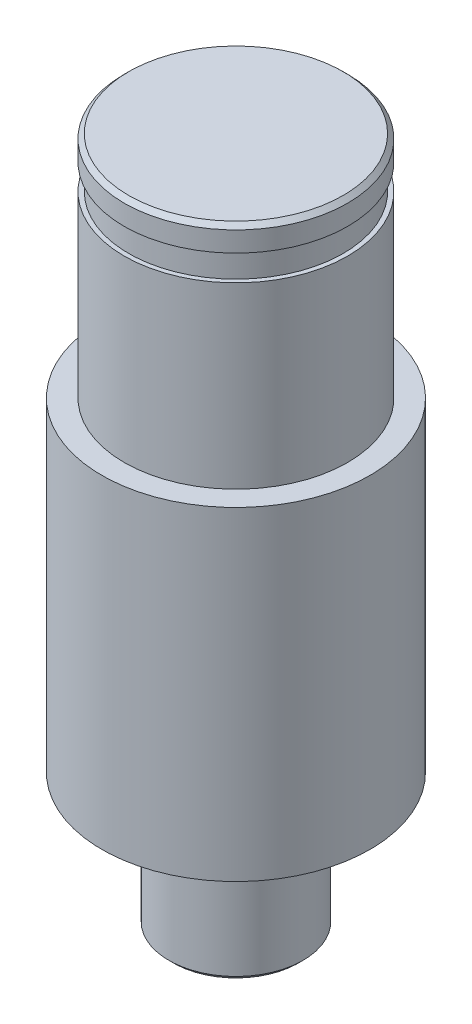
ISO-10303-21;
HEADER;
FILE_DESCRIPTION(('STEP AP214'),'2;1');
FILE_NAME('part.step','',(''),(''),'','','');
FILE_SCHEMA(('AUTOMOTIVE_DESIGN { 1 0 10303 214 1 1 1 1 }'));
ENDSEC;
DATA;
#1=APPLICATION_CONTEXT('core data for automotive mechanical design processes');
#2=APPLICATION_PROTOCOL_DEFINITION('international standard','automotive_design',2000,#1);
#3=PRODUCT_CONTEXT('',#1,'mechanical');
#4=PRODUCT('Part','Part','',(#3));
#5=PRODUCT_RELATED_PRODUCT_CATEGORY('part','',(#4));
#6=PRODUCT_DEFINITION_FORMATION('','',#4);
#7=PRODUCT_DEFINITION_CONTEXT('part definition',#1,'design');
#8=PRODUCT_DEFINITION('design','',#6,#7);
#9=PRODUCT_DEFINITION_SHAPE('','',#8);
#10=(LENGTH_UNIT() NAMED_UNIT(*) SI_UNIT(.MILLI.,.METRE.));
#11=(NAMED_UNIT(*) PLANE_ANGLE_UNIT() SI_UNIT($,.RADIAN.));
#12=(NAMED_UNIT(*) SI_UNIT($,.STERADIAN.) SOLID_ANGLE_UNIT());
#13=UNCERTAINTY_MEASURE_WITH_UNIT(LENGTH_MEASURE(1.E-05),#10,'distance_accuracy_value','');
#14=(GEOMETRIC_REPRESENTATION_CONTEXT(3) GLOBAL_UNCERTAINTY_ASSIGNED_CONTEXT((#13)) GLOBAL_UNIT_ASSIGNED_CONTEXT((#10,
#11,#12)) REPRESENTATION_CONTEXT('',''));
#15=CARTESIAN_POINT('',(0.,0.,0.));
#16=DIRECTION('',(0.,0.,1.));
#17=DIRECTION('',(1.,0.,0.));
#18=AXIS2_PLACEMENT_3D('',#15,#16,#17);
#19=CARTESIAN_POINT('',(3.,0.,0.));
#20=DIRECTION('',(0.,-1.,0.));
#21=DIRECTION('',(0.,0.,-1.));
#22=AXIS2_PLACEMENT_3D('',#19,#20,#21);
#23=PLANE('',#22);
#24=CARTESIAN_POINT('',(0.,0.,0.));
#25=DIRECTION('',(0.,-1.,0.));
#26=DIRECTION('',(0.,0.,-1.));
#27=AXIS2_PLACEMENT_3D('',#24,#25,#26);
#28=CIRCLE('',#27,6.);
#29=CARTESIAN_POINT('',(0.,0.,-6.));
#30=VERTEX_POINT('',#29);
#31=EDGE_CURVE('E50',#30,#30,#28,.T.);
#32=ORIENTED_EDGE('',*,*,#31,.T.);
#33=EDGE_LOOP('',(#32));
#34=FACE_BOUND('',#33,.T.);
#35=CARTESIAN_POINT('',(0.,0.,0.));
#36=DIRECTION('',(0.,-1.,0.));
#37=DIRECTION('',(0.,0.,-1.));
#38=AXIS2_PLACEMENT_3D('',#35,#36,#37);
#39=CIRCLE('',#38,3.);
#40=CARTESIAN_POINT('',(0.,0.,-3.));
#41=VERTEX_POINT('',#40);
#42=EDGE_CURVE('E71',#41,#41,#39,.T.);
#43=ORIENTED_EDGE('',*,*,#42,.F.);
#44=EDGE_LOOP('',(#43));
#45=FACE_BOUND('',#44,.T.);
#46=ADVANCED_FACE('F30',(#34,#45),#23,.T.);
#47=CARTESIAN_POINT('',(0.,0.,0.));
#48=DIRECTION('',(0.,-1.,0.));
#49=DIRECTION('',(0.,0.,-1.));
#50=AXIS2_PLACEMENT_3D('',#47,#48,#49);
#51=CYLINDRICAL_SURFACE('',#50,6.);
#52=CARTESIAN_POINT('',(0.,14.5,0.));
#53=DIRECTION('',(0.,-1.,0.));
#54=DIRECTION('',(0.,0.,-1.));
#55=AXIS2_PLACEMENT_3D('',#52,#53,#54);
#56=CIRCLE('',#55,6.);
#57=CARTESIAN_POINT('',(0.,14.5,-6.));
#58=VERTEX_POINT('',#57);
#59=EDGE_CURVE('E53',#58,#58,#56,.T.);
#60=ORIENTED_EDGE('',*,*,#59,.T.);
#61=EDGE_LOOP('',(#60));
#62=FACE_BOUND('',#61,.T.);
#63=ORIENTED_EDGE('',*,*,#31,.F.);
#64=EDGE_LOOP('',(#63));
#65=FACE_BOUND('',#64,.T.);
#66=ADVANCED_FACE('F78',(#62,#65),#51,.T.);
#67=CARTESIAN_POINT('',(5.,14.5,0.));
#68=DIRECTION('',(0.,1.,0.));
#69=DIRECTION('',(0.,0.,1.));
#70=AXIS2_PLACEMENT_3D('',#67,#68,#69);
#71=PLANE('',#70);
#72=CARTESIAN_POINT('',(0.,14.5,0.));
#73=DIRECTION('',(0.,-1.,0.));
#74=DIRECTION('',(0.,0.,-1.));
#75=AXIS2_PLACEMENT_3D('',#72,#73,#74);
#76=CIRCLE('',#75,5.);
#77=CARTESIAN_POINT('',(0.,14.5,-5.));
#78=VERTEX_POINT('',#77);
#79=EDGE_CURVE('E56',#78,#78,#76,.T.);
#80=ORIENTED_EDGE('',*,*,#79,.T.);
#81=EDGE_LOOP('',(#80));
#82=FACE_BOUND('',#81,.T.);
#83=ORIENTED_EDGE('',*,*,#59,.F.);
#84=EDGE_LOOP('',(#83));
#85=FACE_BOUND('',#84,.T.);
#86=ADVANCED_FACE('F84',(#82,#85),#71,.T.);
#87=CARTESIAN_POINT('',(0.,0.,0.));
#88=DIRECTION('',(0.,-1.,0.));
#89=DIRECTION('',(0.,0.,-1.));
#90=AXIS2_PLACEMENT_3D('',#87,#88,#89);
#91=CYLINDRICAL_SURFACE('',#90,5.);
#92=CARTESIAN_POINT('',(0.,22.5,0.));
#93=DIRECTION('',(0.,-1.,0.));
#94=DIRECTION('',(0.,0.,-1.));
#95=AXIS2_PLACEMENT_3D('',#92,#93,#94);
#96=CIRCLE('',#95,5.);
#97=CARTESIAN_POINT('',(0.,22.5,-5.));
#98=VERTEX_POINT('',#97);
#99=EDGE_CURVE('E59',#98,#98,#96,.T.);
#100=ORIENTED_EDGE('',*,*,#99,.T.);
#101=EDGE_LOOP('',(#100));
#102=FACE_BOUND('',#101,.T.);
#103=ORIENTED_EDGE('',*,*,#79,.F.);
#104=EDGE_LOOP('',(#103));
#105=FACE_BOUND('',#104,.T.);
#106=ADVANCED_FACE('F125',(#102,#105),#91,.T.);
#107=CARTESIAN_POINT('',(5.,22.5,0.));
#108=DIRECTION('',(0.,1.,0.));
#109=DIRECTION('',(0.,0.,1.));
#110=AXIS2_PLACEMENT_3D('',#107,#108,#109);
#111=PLANE('',#110);
#112=CARTESIAN_POINT('',(0.,22.5,0.));
#113=DIRECTION('',(0.,-1.,0.));
#114=DIRECTION('',(0.,0.,-1.));
#115=AXIS2_PLACEMENT_3D('',#112,#113,#114);
#116=CIRCLE('',#115,4.8);
#117=CARTESIAN_POINT('',(0.,22.5,-4.8));
#118=VERTEX_POINT('',#117);
#119=EDGE_CURVE('E62',#118,#118,#116,.T.);
#120=ORIENTED_EDGE('',*,*,#119,.T.);
#121=EDGE_LOOP('',(#120));
#122=FACE_BOUND('',#121,.T.);
#123=ORIENTED_EDGE('',*,*,#99,.F.);
#124=EDGE_LOOP('',(#123));
#125=FACE_BOUND('',#124,.T.);
#126=ADVANCED_FACE('F121',(#122,#125),#111,.T.);
#127=CARTESIAN_POINT('',(0.,0.,0.));
#128=DIRECTION('',(0.,-1.,0.));
#129=DIRECTION('',(0.,0.,-1.));
#130=AXIS2_PLACEMENT_3D('',#127,#128,#129);
#131=CYLINDRICAL_SURFACE('',#130,4.8);
#132=CARTESIAN_POINT('',(0.,23.65,0.));
#133=DIRECTION('',(0.,-1.,0.));
#134=DIRECTION('',(0.,0.,-1.));
#135=AXIS2_PLACEMENT_3D('',#132,#133,#134);
#136=CIRCLE('',#135,4.8);
#137=CARTESIAN_POINT('',(0.,23.65,-4.8));
#138=VERTEX_POINT('',#137);
#139=EDGE_CURVE('E65',#138,#138,#136,.T.);
#140=ORIENTED_EDGE('',*,*,#139,.T.);
#141=EDGE_LOOP('',(#140));
#142=FACE_BOUND('',#141,.T.);
#143=ORIENTED_EDGE('',*,*,#119,.F.);
#144=EDGE_LOOP('',(#143));
#145=FACE_BOUND('',#144,.T.);
#146=ADVANCED_FACE('F117',(#142,#145),#131,.T.);
#147=CARTESIAN_POINT('',(5.,23.65,0.));
#148=DIRECTION('',(0.,-1.,0.));
#149=DIRECTION('',(0.,0.,-1.));
#150=AXIS2_PLACEMENT_3D('',#147,#148,#149);
#151=PLANE('',#150);
#152=CARTESIAN_POINT('',(0.,23.65,0.));
#153=DIRECTION('',(0.,-1.,0.));
#154=DIRECTION('',(0.,0.,-1.));
#155=AXIS2_PLACEMENT_3D('',#152,#153,#154);
#156=CIRCLE('',#155,5.);
#157=CARTESIAN_POINT('',(0.,23.65,-5.));
#158=VERTEX_POINT('',#157);
#159=EDGE_CURVE('E68',#158,#158,#156,.T.);
#160=ORIENTED_EDGE('',*,*,#159,.T.);
#161=EDGE_LOOP('',(#160));
#162=FACE_BOUND('',#161,.T.);
#163=ORIENTED_EDGE('',*,*,#139,.F.);
#164=EDGE_LOOP('',(#163));
#165=FACE_BOUND('',#164,.T.);
#166=ADVANCED_FACE('F114',(#162,#165),#151,.T.);
#167=CARTESIAN_POINT('',(0.,0.,0.));
#168=DIRECTION('',(0.,-1.,0.));
#169=DIRECTION('',(0.,0.,-1.));
#170=AXIS2_PLACEMENT_3D('',#167,#168,#169);
#171=CYLINDRICAL_SURFACE('',#170,5.);
#172=CARTESIAN_POINT('',(0.,24.55,0.));
#173=DIRECTION('',(0.,1.,0.));
#174=DIRECTION('',(0.,0.,1.));
#175=AXIS2_PLACEMENT_3D('',#172,#173,#174);
#176=CIRCLE('',#175,5.);
#177=CARTESIAN_POINT('',(0.,24.55,5.));
#178=VERTEX_POINT('',#177);
#179=EDGE_CURVE('E37',#178,#178,#176,.F.);
#180=ORIENTED_EDGE('',*,*,#179,.T.);
#181=EDGE_LOOP('',(#180));
#182=FACE_BOUND('',#181,.T.);
#183=ORIENTED_EDGE('',*,*,#159,.F.);
#184=EDGE_LOOP('',(#183));
#185=FACE_BOUND('',#184,.T.);
#186=ADVANCED_FACE('F109',(#182,#185),#171,.T.);
#187=CARTESIAN_POINT('',(0.,24.75,0.));
#188=DIRECTION('',(0.,1.,0.));
#189=DIRECTION('',(0.,0.,1.));
#190=AXIS2_PLACEMENT_3D('',#187,#188,#189);
#191=PLANE('',#190);
#192=CARTESIAN_POINT('',(0.,24.75,0.));
#193=DIRECTION('',(0.,1.,0.));
#194=DIRECTION('',(0.,0.,1.));
#195=AXIS2_PLACEMENT_3D('',#192,#193,#194);
#196=CIRCLE('',#195,4.80000000000001);
#197=CARTESIAN_POINT('',(0.,24.75,4.80000000000001));
#198=VERTEX_POINT('',#197);
#199=EDGE_CURVE('E10',#198,#198,#196,.T.);
#200=ORIENTED_EDGE('',*,*,#199,.T.);
#201=EDGE_LOOP('',(#200));
#202=FACE_BOUND('',#201,.T.);
#203=ADVANCED_FACE('F104',(#202),#191,.T.);
#204=CARTESIAN_POINT('',(0.,-6.,0.));
#205=DIRECTION('',(0.,-1.,0.));
#206=DIRECTION('',(0.,0.,-1.));
#207=AXIS2_PLACEMENT_3D('',#204,#205,#206);
#208=PLANE('',#207);
#209=CARTESIAN_POINT('',(0.,-6.,0.));
#210=DIRECTION('',(0.,-1.,0.));
#211=DIRECTION('',(0.,0.,-1.));
#212=AXIS2_PLACEMENT_3D('',#209,#210,#211);
#213=CIRCLE('',#212,2.79999999999999);
#214=CARTESIAN_POINT('',(0.,-6.,-2.79999999999999));
#215=VERTEX_POINT('',#214);
#216=EDGE_CURVE('E45',#215,#215,#213,.T.);
#217=ORIENTED_EDGE('',*,*,#216,.T.);
#218=EDGE_LOOP('',(#217));
#219=FACE_BOUND('',#218,.T.);
#220=ADVANCED_FACE('F96',(#219),#208,.T.);
#221=CARTESIAN_POINT('',(0.,0.,0.));
#222=DIRECTION('',(0.,-1.,0.));
#223=DIRECTION('',(0.,0.,-1.));
#224=AXIS2_PLACEMENT_3D('',#221,#222,#223);
#225=CYLINDRICAL_SURFACE('',#224,3.);
#226=CARTESIAN_POINT('',(0.,-5.79999999999999,0.));
#227=DIRECTION('',(0.,-1.,0.));
#228=DIRECTION('',(0.,0.,-1.));
#229=AXIS2_PLACEMENT_3D('',#226,#227,#228);
#230=CIRCLE('',#229,3.);
#231=CARTESIAN_POINT('',(0.,-5.79999999999999,-3.));
#232=VERTEX_POINT('',#231);
#233=EDGE_CURVE('E41',#232,#232,#230,.F.);
#234=ORIENTED_EDGE('',*,*,#233,.T.);
#235=EDGE_LOOP('',(#234));
#236=FACE_BOUND('',#235,.T.);
#237=ORIENTED_EDGE('',*,*,#42,.T.);
#238=EDGE_LOOP('',(#237));
#239=FACE_BOUND('',#238,.T.);
#240=ADVANCED_FACE('F75',(#236,#239),#225,.T.);
#241=CARTESIAN_POINT('',(0.,-6.,0.));
#242=DIRECTION('',(0.,1.,0.));
#243=DIRECTION('',(0.,0.,1.));
#244=AXIS2_PLACEMENT_3D('',#241,#242,#243);
#245=CONICAL_SURFACE('',#244,2.79999999999999,0.785398163397453);
#246=ORIENTED_EDGE('',*,*,#233,.F.);
#247=EDGE_LOOP('',(#246));
#248=FACE_BOUND('',#247,.T.);
#249=ORIENTED_EDGE('',*,*,#216,.F.);
#250=EDGE_LOOP('',(#249));
#251=FACE_BOUND('',#250,.T.);
#252=ADVANCED_FACE('F88',(#248,#251),#245,.T.);
#253=CARTESIAN_POINT('',(0.,24.55,0.));
#254=DIRECTION('',(0.,-1.,0.));
#255=DIRECTION('',(0.,0.,-1.));
#256=AXIS2_PLACEMENT_3D('',#253,#254,#255);
#257=CONICAL_SURFACE('',#256,5.,0.785398163397438);
#258=ORIENTED_EDGE('',*,*,#199,.F.);
#259=EDGE_LOOP('',(#258));
#260=FACE_BOUND('',#259,.T.);
#261=ORIENTED_EDGE('',*,*,#179,.F.);
#262=EDGE_LOOP('',(#261));
#263=FACE_BOUND('',#262,.T.);
#264=ADVANCED_FACE('F32',(#260,#263),#257,.T.);
#265=CLOSED_SHELL('',(#46,#66,#86,#106,#126,#146,#166,#186,#203,#220,#240,#252,#264));
#266=MANIFOLD_SOLID_BREP('B2',#265);
#267=ADVANCED_BREP_SHAPE_REPRESENTATION('',(#18,#266),#14);
#268=SHAPE_DEFINITION_REPRESENTATION(#9,#267);
ENDSEC;
END-ISO-10303-21;
